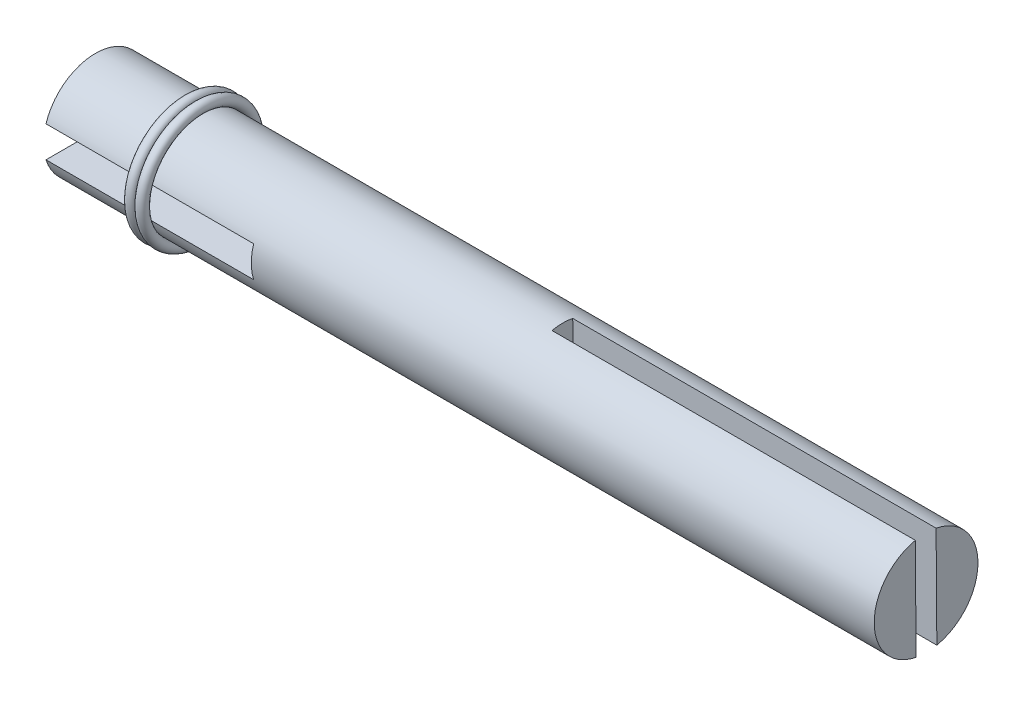
ISO-10303-21;
HEADER;
FILE_DESCRIPTION(('STEP AP214'),'2;1');
FILE_NAME('part.step','',(''),(''),'','','');
FILE_SCHEMA(('AUTOMOTIVE_DESIGN { 1 0 10303 214 1 1 1 1 }'));
ENDSEC;
DATA;
#1=APPLICATION_CONTEXT('core data for automotive mechanical design processes');
#2=APPLICATION_PROTOCOL_DEFINITION('international standard','automotive_design',2000,#1);
#3=PRODUCT_CONTEXT('',#1,'mechanical');
#4=PRODUCT('Part','Part','',(#3));
#5=PRODUCT_RELATED_PRODUCT_CATEGORY('part','',(#4));
#6=PRODUCT_DEFINITION_FORMATION('','',#4);
#7=PRODUCT_DEFINITION_CONTEXT('part definition',#1,'design');
#8=PRODUCT_DEFINITION('design','',#6,#7);
#9=PRODUCT_DEFINITION_SHAPE('','',#8);
#10=(LENGTH_UNIT() NAMED_UNIT(*) SI_UNIT(.MILLI.,.METRE.));
#11=(NAMED_UNIT(*) PLANE_ANGLE_UNIT() SI_UNIT($,.RADIAN.));
#12=(NAMED_UNIT(*) SI_UNIT($,.STERADIAN.) SOLID_ANGLE_UNIT());
#13=UNCERTAINTY_MEASURE_WITH_UNIT(LENGTH_MEASURE(1.E-05),#10,'distance_accuracy_value','');
#14=(GEOMETRIC_REPRESENTATION_CONTEXT(3) GLOBAL_UNCERTAINTY_ASSIGNED_CONTEXT((#13)) GLOBAL_UNIT_ASSIGNED_CONTEXT((#10,
#11,#12)) REPRESENTATION_CONTEXT('',''));
#15=CARTESIAN_POINT('',(0.,0.,0.));
#16=DIRECTION('',(0.,0.,1.));
#17=DIRECTION('',(1.,0.,0.));
#18=AXIS2_PLACEMENT_3D('',#15,#16,#17);
#19=CARTESIAN_POINT('',(9.,0.,0.));
#20=DIRECTION('',(-1.,0.,0.));
#21=DIRECTION('',(0.,0.,-1.));
#22=AXIS2_PLACEMENT_3D('',#19,#20,#21);
#23=TOROIDAL_SURFACE('',#22,5.5,0.500000000000001);
#24=CARTESIAN_POINT('',(9.,5.5,0.));
#25=DIRECTION('',(0.,0.,-1.));
#26=DIRECTION('',(-1.,0.,0.));
#27=AXIS2_PLACEMENT_3D('',#24,#25,#26);
#28=CIRCLE('',#27,0.500000000000001);
#29=CARTESIAN_POINT('',(9.,6.,0.));
#30=VERTEX_POINT('',#29);
#31=EDGE_CURVE('E13',#30,#30,#28,.T.);
#32=CARTESIAN_POINT('',(9.,0.,0.));
#33=DIRECTION('',(-1.,0.,0.));
#34=DIRECTION('',(0.,0.,-1.));
#35=AXIS2_PLACEMENT_3D('',#32,#33,#34);
#36=CIRCLE('',#35,6.);
#37=EDGE_CURVE('',#30,#30,#36,.T.);
#38=ORIENTED_EDGE('',*,*,#31,.T.);
#39=ORIENTED_EDGE('',*,*,#31,.F.);
#40=ORIENTED_EDGE('',*,*,#37,.T.);
#41=ORIENTED_EDGE('',*,*,#37,.F.);
#42=EDGE_LOOP('',(#38,#40,#39,#41));
#43=FACE_BOUND('',#42,.T.);
#44=ADVANCED_FACE('F55',(#43),#23,.T.);
#45=OPEN_SHELL('',(#44));
#46=SHELL_BASED_SURFACE_MODEL('B2',(#45));
#47=CARTESIAN_POINT('',(10.,0.,0.));
#48=DIRECTION('',(1.,0.,0.));
#49=DIRECTION('',(0.,0.,-1.));
#50=AXIS2_PLACEMENT_3D('',#47,#48,#49);
#51=TOROIDAL_SURFACE('',#50,5.5,0.500000000000001);
#52=CARTESIAN_POINT('',(10.,5.5,0.));
#53=DIRECTION('',(0.,0.,1.));
#54=DIRECTION('',(1.,0.,0.));
#55=AXIS2_PLACEMENT_3D('',#52,#53,#54);
#56=CIRCLE('',#55,0.500000000000001);
#57=CARTESIAN_POINT('',(10.,6.,0.));
#58=VERTEX_POINT('',#57);
#59=EDGE_CURVE('E54',#58,#58,#56,.T.);
#60=CARTESIAN_POINT('',(10.,0.,0.));
#61=DIRECTION('',(1.,0.,0.));
#62=DIRECTION('',(0.,0.,-1.));
#63=AXIS2_PLACEMENT_3D('',#60,#61,#62);
#64=CIRCLE('',#63,6.);
#65=EDGE_CURVE('',#58,#58,#64,.T.);
#66=ORIENTED_EDGE('',*,*,#59,.T.);
#67=ORIENTED_EDGE('',*,*,#59,.F.);
#68=ORIENTED_EDGE('',*,*,#65,.T.);
#69=ORIENTED_EDGE('',*,*,#65,.F.);
#70=EDGE_LOOP('',(#66,#68,#67,#69));
#71=FACE_BOUND('',#70,.T.);
#72=ADVANCED_FACE('F87',(#71),#51,.T.);
#73=OPEN_SHELL('',(#72));
#74=SHELL_BASED_SURFACE_MODEL('B8',(#73));
#75=CARTESIAN_POINT('',(80.,0.,0.));
#76=DIRECTION('',(1.,0.,0.));
#77=DIRECTION('',(0.,0.,-1.));
#78=AXIS2_PLACEMENT_3D('',#75,#76,#77);
#79=PLANE('',#78);
#80=DIRECTION('',(0.,0.999974475934786,0.00714475184672542));
#81=VECTOR('',#80,1.);
#82=CARTESIAN_POINT('',(80.,0.00714523923706772,-1.00004269074616));
#83=LINE('',#82,#81);
#84=CARTESIAN_POINT('',(80.,-4.89169527967263,-1.03504458398107));
#85=VERTEX_POINT('',#84);
#86=CARTESIAN_POINT('',(80.,4.90598575814676,-0.965040797511252));
#87=VERTEX_POINT('',#86);
#88=EDGE_CURVE('E178',#85,#87,#83,.T.);
#89=ORIENTED_EDGE('',*,*,#88,.F.);
#90=CARTESIAN_POINT('',(80.,0.,0.));
#91=DIRECTION('',(1.,0.,0.));
#92=DIRECTION('',(0.,0.,-1.));
#93=AXIS2_PLACEMENT_3D('',#90,#91,#92);
#94=CIRCLE('',#93,5.);
#95=EDGE_CURVE('E191',#85,#87,#94,.T.);
#96=ORIENTED_EDGE('',*,*,#95,.T.);
#97=EDGE_LOOP('',(#89,#96));
#98=FACE_BOUND('',#97,.T.);
#99=ADVANCED_FACE('F107',(#98),#79,.T.);
#100=CARTESIAN_POINT('',(80.,0.,0.));
#101=DIRECTION('',(-1.,0.,0.));
#102=DIRECTION('',(0.,0.,1.));
#103=AXIS2_PLACEMENT_3D('',#100,#101,#102);
#104=CYLINDRICAL_SURFACE('',#103,5.);
#105=CARTESIAN_POINT('',(45.,0.,0.));
#106=DIRECTION('',(1.,0.,0.));
#107=DIRECTION('',(0.,0.,-1.));
#108=AXIS2_PLACEMENT_3D('',#105,#106,#107);
#109=CIRCLE('',#108,5.);
#110=CARTESIAN_POINT('',(45.,4.90598575814676,-0.965040797511252));
#111=VERTEX_POINT('',#110);
#112=CARTESIAN_POINT('',(45.,4.89171331860531,1.03495932701697));
#113=VERTEX_POINT('',#112);
#114=EDGE_CURVE('E85',#111,#113,#109,.T.);
#115=ORIENTED_EDGE('',*,*,#114,.F.);
#116=DIRECTION('',(-1.,0.,0.));
#117=VECTOR('',#116,1.);
#118=CARTESIAN_POINT('',(80.,4.90598575814676,-0.965040797511252));
#119=LINE('',#118,#117);
#120=EDGE_CURVE('E217',#111,#87,#119,.F.);
#121=ORIENTED_EDGE('',*,*,#120,.T.);
#122=ORIENTED_EDGE('',*,*,#95,.F.);
#123=DIRECTION('',(-1.,0.,0.));
#124=VECTOR('',#123,1.);
#125=CARTESIAN_POINT('',(80.,-4.89169527967263,-1.03504458398107));
#126=LINE('',#125,#124);
#127=CARTESIAN_POINT('',(45.,-4.89169527967263,-1.03504458398107));
#128=VERTEX_POINT('',#127);
#129=EDGE_CURVE('E216',#85,#128,#126,.T.);
#130=ORIENTED_EDGE('',*,*,#129,.T.);
#131=CARTESIAN_POINT('',(45.,-4.90600257698914,0.964955291490655));
#132=VERTEX_POINT('',#131);
#133=EDGE_CURVE('E111',#132,#128,#109,.T.);
#134=ORIENTED_EDGE('',*,*,#133,.F.);
#135=DIRECTION('',(-1.,0.,0.));
#136=VECTOR('',#135,1.);
#137=CARTESIAN_POINT('',(80.,-4.90600257698914,0.964955291490655));
#138=LINE('',#137,#136);
#139=CARTESIAN_POINT('',(80.,-4.90600257698914,0.964955291490655));
#140=VERTEX_POINT('',#139);
#141=EDGE_CURVE('E173',#132,#140,#138,.F.);
#142=ORIENTED_EDGE('',*,*,#141,.T.);
#143=CARTESIAN_POINT('',(80.,4.89171331860531,1.03495932701697));
#144=VERTEX_POINT('',#143);
#145=EDGE_CURVE('E185',#144,#140,#94,.T.);
#146=ORIENTED_EDGE('',*,*,#145,.F.);
#147=DIRECTION('',(-1.,0.,0.));
#148=VECTOR('',#147,1.);
#149=CARTESIAN_POINT('',(80.,4.89171331860531,1.03495932701697));
#150=LINE('',#149,#148);
#151=EDGE_CURVE('E122',#144,#113,#150,.T.);
#152=ORIENTED_EDGE('',*,*,#151,.T.);
#153=EDGE_LOOP('',(#115,#121,#122,#130,#134,#142,#146,#152));
#154=FACE_BOUND('',#153,.T.);
#155=DIRECTION('',(-1.,0.,0.));
#156=VECTOR('',#155,1.);
#157=CARTESIAN_POINT('',(80.,1.5,4.76969600708471));
#158=LINE('',#157,#156);
#159=CARTESIAN_POINT('',(20.,1.5,4.76969600708471));
#160=VERTEX_POINT('',#159);
#161=CARTESIAN_POINT('',(0.,1.5,4.76969600708471));
#162=VERTEX_POINT('',#161);
#163=EDGE_CURVE('E199',#160,#162,#158,.T.);
#164=ORIENTED_EDGE('',*,*,#163,.F.);
#165=CARTESIAN_POINT('',(20.,0.,0.));
#166=DIRECTION('',(1.,0.,0.));
#167=DIRECTION('',(0.,0.,-1.));
#168=AXIS2_PLACEMENT_3D('',#165,#166,#167);
#169=CIRCLE('',#168,5.);
#170=CARTESIAN_POINT('',(20.,-1.5,4.76969600708471));
#171=VERTEX_POINT('',#170);
#172=EDGE_CURVE('E179',#160,#171,#169,.T.);
#173=ORIENTED_EDGE('',*,*,#172,.T.);
#174=DIRECTION('',(-1.,0.,0.));
#175=VECTOR('',#174,1.);
#176=CARTESIAN_POINT('',(80.,-1.5,4.76969600708471));
#177=LINE('',#176,#175);
#178=CARTESIAN_POINT('',(0.,-1.5,4.76969600708471));
#179=VERTEX_POINT('',#178);
#180=EDGE_CURVE('E229',#179,#171,#177,.F.);
#181=ORIENTED_EDGE('',*,*,#180,.F.);
#182=CARTESIAN_POINT('',(0.,0.,0.));
#183=DIRECTION('',(1.,0.,0.));
#184=DIRECTION('',(0.,0.,-1.));
#185=AXIS2_PLACEMENT_3D('',#182,#183,#184);
#186=CIRCLE('',#185,5.);
#187=CARTESIAN_POINT('',(0.,-1.5,-4.76969600708471));
#188=VERTEX_POINT('',#187);
#189=EDGE_CURVE('E202',#179,#188,#186,.T.);
#190=ORIENTED_EDGE('',*,*,#189,.T.);
#191=DIRECTION('',(-1.,0.,0.));
#192=VECTOR('',#191,1.);
#193=CARTESIAN_POINT('',(80.,-1.5,-4.76969600708471));
#194=LINE('',#193,#192);
#195=CARTESIAN_POINT('',(20.,-1.5,-4.76969600708471));
#196=VERTEX_POINT('',#195);
#197=EDGE_CURVE('E130',#196,#188,#194,.T.);
#198=ORIENTED_EDGE('',*,*,#197,.F.);
#199=CARTESIAN_POINT('',(20.,1.5,-4.76969600708471));
#200=VERTEX_POINT('',#199);
#201=EDGE_CURVE('E205',#196,#200,#169,.T.);
#202=ORIENTED_EDGE('',*,*,#201,.T.);
#203=DIRECTION('',(-1.,0.,0.));
#204=VECTOR('',#203,1.);
#205=CARTESIAN_POINT('',(80.,1.5,-4.76969600708471));
#206=LINE('',#205,#204);
#207=CARTESIAN_POINT('',(0.,1.5,-4.76969600708471));
#208=VERTEX_POINT('',#207);
#209=EDGE_CURVE('E231',#208,#200,#206,.F.);
#210=ORIENTED_EDGE('',*,*,#209,.F.);
#211=EDGE_CURVE('E196',#208,#162,#186,.T.);
#212=ORIENTED_EDGE('',*,*,#211,.T.);
#213=EDGE_LOOP('',(#164,#173,#181,#190,#198,#202,#210,#212));
#214=FACE_BOUND('',#213,.T.);
#215=ADVANCED_FACE('F109',(#154,#214),#104,.T.);
#216=CARTESIAN_POINT('',(0.,0.,0.));
#217=DIRECTION('',(1.,0.,0.));
#218=DIRECTION('',(0.,0.,-1.));
#219=AXIS2_PLACEMENT_3D('',#216,#217,#218);
#220=PLANE('',#219);
#221=DIRECTION('',(0.,0.,-1.));
#222=VECTOR('',#221,1.);
#223=CARTESIAN_POINT('',(0.,1.5,0.));
#224=LINE('',#223,#222);
#225=EDGE_CURVE('E193',#162,#208,#224,.T.);
#226=ORIENTED_EDGE('',*,*,#225,.F.);
#227=ORIENTED_EDGE('',*,*,#211,.F.);
#228=EDGE_LOOP('',(#226,#227));
#229=FACE_BOUND('',#228,.T.);
#230=ADVANCED_FACE('F249',(#229),#220,.F.);
#231=DIRECTION('',(0.,0.,1.));
#232=VECTOR('',#231,1.);
#233=CARTESIAN_POINT('',(0.,-1.5,0.));
#234=LINE('',#233,#232);
#235=EDGE_CURVE('E190',#188,#179,#234,.T.);
#236=ORIENTED_EDGE('',*,*,#235,.F.);
#237=ORIENTED_EDGE('',*,*,#189,.F.);
#238=EDGE_LOOP('',(#236,#237));
#239=FACE_BOUND('',#238,.T.);
#240=ADVANCED_FACE('F242',(#239),#220,.F.);
#241=DIRECTION('',(0.,-0.999974475934786,-0.00714475184672554));
#242=VECTOR('',#241,1.);
#243=CARTESIAN_POINT('',(80.,-0.00714462919192138,0.999957309253841));
#244=LINE('',#243,#242);
#245=EDGE_CURVE('E170',#144,#140,#244,.T.);
#246=ORIENTED_EDGE('',*,*,#245,.F.);
#247=ORIENTED_EDGE('',*,*,#145,.T.);
#248=EDGE_LOOP('',(#246,#247));
#249=FACE_BOUND('',#248,.T.);
#250=ADVANCED_FACE('F189',(#249),#79,.T.);
#251=CARTESIAN_POINT('',(20.,0.,0.));
#252=DIRECTION('',(1.,0.,0.));
#253=DIRECTION('',(0.,0.,-1.));
#254=AXIS2_PLACEMENT_3D('',#251,#252,#253);
#255=PLANE('',#254);
#256=DIRECTION('',(0.,0.,1.));
#257=VECTOR('',#256,1.);
#258=CARTESIAN_POINT('',(20.,1.5,-7.0205536911776));
#259=LINE('',#258,#257);
#260=EDGE_CURVE('E220',#200,#160,#259,.T.);
#261=ORIENTED_EDGE('',*,*,#260,.F.);
#262=ORIENTED_EDGE('',*,*,#201,.F.);
#263=DIRECTION('',(0.,0.,-1.));
#264=VECTOR('',#263,1.);
#265=CARTESIAN_POINT('',(20.,-1.5,6.5805235701859));
#266=LINE('',#265,#264);
#267=EDGE_CURVE('E223',#171,#196,#266,.T.);
#268=ORIENTED_EDGE('',*,*,#267,.F.);
#269=ORIENTED_EDGE('',*,*,#172,.F.);
#270=EDGE_LOOP('',(#261,#262,#268,#269));
#271=FACE_BOUND('',#270,.T.);
#272=ADVANCED_FACE('F246',(#271),#255,.F.);
#273=CARTESIAN_POINT('',(20.,1.5,-7.0205536911776));
#274=DIRECTION('',(0.,-1.,0.));
#275=DIRECTION('',(0.,0.,-1.));
#276=AXIS2_PLACEMENT_3D('',#273,#274,#275);
#277=PLANE('',#276);
#278=ORIENTED_EDGE('',*,*,#163,.T.);
#279=ORIENTED_EDGE('',*,*,#225,.T.);
#280=ORIENTED_EDGE('',*,*,#209,.T.);
#281=ORIENTED_EDGE('',*,*,#260,.T.);
#282=EDGE_LOOP('',(#278,#279,#280,#281));
#283=FACE_BOUND('',#282,.T.);
#284=ADVANCED_FACE('F250',(#283),#277,.T.);
#285=CARTESIAN_POINT('',(20.,-1.5,6.5805235701859));
#286=DIRECTION('',(0.,1.,0.));
#287=DIRECTION('',(0.,0.,1.));
#288=AXIS2_PLACEMENT_3D('',#285,#286,#287);
#289=PLANE('',#288);
#290=ORIENTED_EDGE('',*,*,#197,.T.);
#291=ORIENTED_EDGE('',*,*,#235,.T.);
#292=ORIENTED_EDGE('',*,*,#180,.T.);
#293=ORIENTED_EDGE('',*,*,#267,.T.);
#294=EDGE_LOOP('',(#290,#291,#292,#293));
#295=FACE_BOUND('',#294,.T.);
#296=ADVANCED_FACE('F243',(#295),#289,.T.);
#297=CARTESIAN_POINT('',(45.,0.,0.));
#298=DIRECTION('',(1.,0.,0.));
#299=DIRECTION('',(0.,0.,-1.));
#300=AXIS2_PLACEMENT_3D('',#297,#298,#299);
#301=PLANE('',#300);
#302=ORIENTED_EDGE('',*,*,#114,.T.);
#303=DIRECTION('',(0.,-0.999974475934785,-0.0071447518467253));
#304=VECTOR('',#303,1.);
#305=CARTESIAN_POINT('',(45.,11.990635656664,1.08568066011622));
#306=LINE('',#305,#304);
#307=EDGE_CURVE('E214',#113,#132,#306,.T.);
#308=ORIENTED_EDGE('',*,*,#307,.T.);
#309=ORIENTED_EDGE('',*,*,#133,.T.);
#310=DIRECTION('',(0.,0.999974475934785,0.00714475184672542));
#311=VECTOR('',#310,1.);
#312=CARTESIAN_POINT('',(45.,-11.9944618973419,-1.08579338420522));
#313=LINE('',#312,#311);
#314=EDGE_CURVE('E187',#128,#111,#313,.T.);
#315=ORIENTED_EDGE('',*,*,#314,.T.);
#316=EDGE_LOOP('',(#302,#308,#309,#315));
#317=FACE_BOUND('',#316,.T.);
#318=ADVANCED_FACE('F213',(#317),#301,.T.);
#319=CARTESIAN_POINT('',(45.,-11.9944618973419,-1.08579338420522));
#320=DIRECTION('',(0.,0.00714475184672542,-0.999974475934785));
#321=DIRECTION('',(0.,0.999974475934786,0.00714475184672542));
#322=AXIS2_PLACEMENT_3D('',#319,#320,#321);
#323=PLANE('',#322);
#324=ORIENTED_EDGE('',*,*,#88,.T.);
#325=ORIENTED_EDGE('',*,*,#120,.F.);
#326=ORIENTED_EDGE('',*,*,#314,.F.);
#327=ORIENTED_EDGE('',*,*,#129,.F.);
#328=EDGE_LOOP('',(#324,#325,#326,#327));
#329=FACE_BOUND('',#328,.T.);
#330=ADVANCED_FACE('F215',(#329),#323,.F.);
#331=CARTESIAN_POINT('',(45.,-0.00905805455343051,0.999943637955525));
#332=DIRECTION('',(0.,-0.00714475184672554,0.999974475934785));
#333=DIRECTION('',(0.,-0.999974475934786,-0.00714475184672554));
#334=AXIS2_PLACEMENT_3D('',#331,#332,#333);
#335=PLANE('',#334);
#336=ORIENTED_EDGE('',*,*,#245,.T.);
#337=ORIENTED_EDGE('',*,*,#141,.F.);
#338=ORIENTED_EDGE('',*,*,#307,.F.);
#339=ORIENTED_EDGE('',*,*,#151,.F.);
#340=EDGE_LOOP('',(#336,#337,#338,#339));
#341=FACE_BOUND('',#340,.T.);
#342=ADVANCED_FACE('F172',(#341),#335,.F.);
#343=CLOSED_SHELL('',(#99,#215,#230,#240,#250,#272,#284,#296,#318,#330,#342));
#344=MANIFOLD_SOLID_BREP('B49',#343);
#345=ADVANCED_BREP_SHAPE_REPRESENTATION('',(#18,#344),#14);
#346=MANIFOLD_SURFACE_SHAPE_REPRESENTATION('',(#18,#46,#74),#14);
#347=SHAPE_REPRESENTATION('',(#18),#14);
#348=SHAPE_DEFINITION_REPRESENTATION(#9,#347);
#349=SHAPE_REPRESENTATION_RELATIONSHIP('','',#347,#345);
#350=SHAPE_REPRESENTATION_RELATIONSHIP('','',#347,#346);
ENDSEC;
END-ISO-10303-21;
